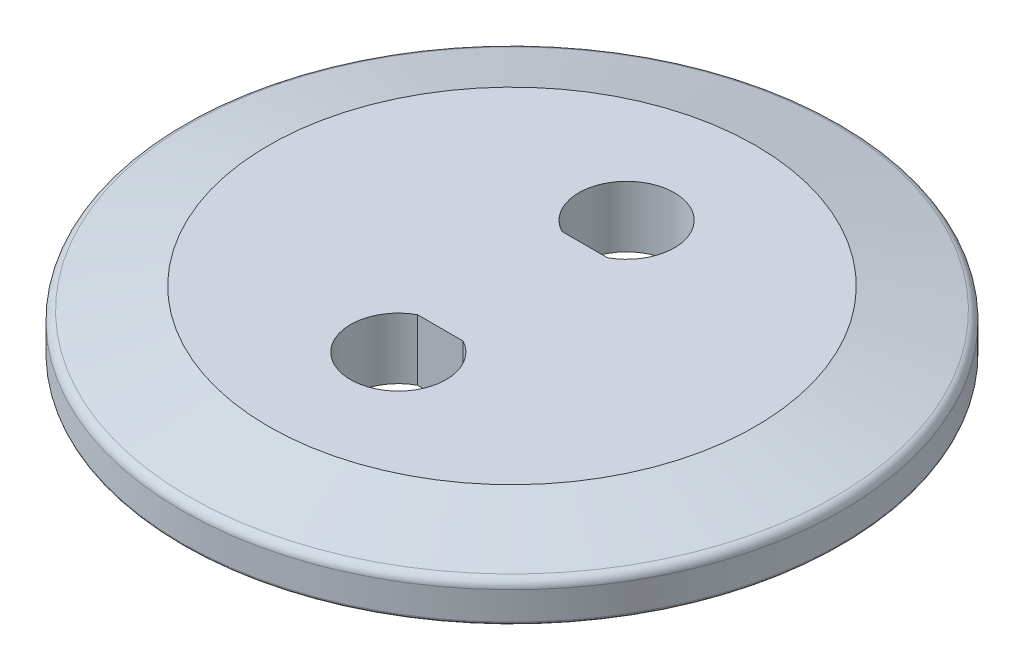
ISO-10303-21;
HEADER;
FILE_DESCRIPTION(('STEP AP214'),'2;1');
FILE_NAME('part.step','',(''),(''),'','','');
FILE_SCHEMA(('AUTOMOTIVE_DESIGN { 1 0 10303 214 1 1 1 1 }'));
ENDSEC;
DATA;
#1=APPLICATION_CONTEXT('core data for automotive mechanical design processes');
#2=APPLICATION_PROTOCOL_DEFINITION('international standard','automotive_design',2000,#1);
#3=PRODUCT_CONTEXT('',#1,'mechanical');
#4=PRODUCT('Part','Part','',(#3));
#5=PRODUCT_RELATED_PRODUCT_CATEGORY('part','',(#4));
#6=PRODUCT_DEFINITION_FORMATION('','',#4);
#7=PRODUCT_DEFINITION_CONTEXT('part definition',#1,'design');
#8=PRODUCT_DEFINITION('design','',#6,#7);
#9=PRODUCT_DEFINITION_SHAPE('','',#8);
#10=(LENGTH_UNIT() NAMED_UNIT(*) SI_UNIT(.MILLI.,.METRE.));
#11=(NAMED_UNIT(*) PLANE_ANGLE_UNIT() SI_UNIT($,.RADIAN.));
#12=(NAMED_UNIT(*) SI_UNIT($,.STERADIAN.) SOLID_ANGLE_UNIT());
#13=UNCERTAINTY_MEASURE_WITH_UNIT(LENGTH_MEASURE(1.E-05),#10,'distance_accuracy_value','');
#14=(GEOMETRIC_REPRESENTATION_CONTEXT(3) GLOBAL_UNCERTAINTY_ASSIGNED_CONTEXT((#13)) GLOBAL_UNIT_ASSIGNED_CONTEXT((#10,
#11,#12)) REPRESENTATION_CONTEXT('',''));
#15=CARTESIAN_POINT('',(0.,0.,0.));
#16=DIRECTION('',(0.,0.,1.));
#17=DIRECTION('',(1.,0.,0.));
#18=AXIS2_PLACEMENT_3D('',#15,#16,#17);
#19=CARTESIAN_POINT('',(0.,5.1,20.3158021954298));
#20=DIRECTION('',(0.,-1.,0.));
#21=DIRECTION('',(0.,0.,-1.));
#22=AXIS2_PLACEMENT_3D('',#19,#20,#21);
#23=PLANE('',#22);
#24=CARTESIAN_POINT('',(0.,5.1,0.));
#25=DIRECTION('',(0.,-1.,0.));
#26=DIRECTION('',(0.,0.,-1.));
#27=AXIS2_PLACEMENT_3D('',#24,#25,#26);
#28=CIRCLE('',#27,20.3158021954298);
#29=CARTESIAN_POINT('',(0.,5.1,-20.3158021954298));
#30=VERTEX_POINT('',#29);
#31=EDGE_CURVE('E149',#30,#30,#28,.T.);
#32=ORIENTED_EDGE('',*,*,#31,.F.);
#33=EDGE_LOOP('',(#32));
#34=FACE_BOUND('',#33,.T.);
#35=DIRECTION('',(1.,0.,0.));
#36=VECTOR('',#35,1.);
#37=CARTESIAN_POINT('',(-1.86254762289826,5.1,-6.0198));
#38=LINE('',#37,#36);
#39=CARTESIAN_POINT('',(-1.86254762289826,5.1,-6.0198));
#40=VERTEX_POINT('',#39);
#41=CARTESIAN_POINT('',(1.94067301230029,5.1,-6.0198));
#42=VERTEX_POINT('',#41);
#43=EDGE_CURVE('E117',#40,#42,#38,.T.);
#44=ORIENTED_EDGE('',*,*,#43,.F.);
#45=CARTESIAN_POINT('',(0.0390626947010149,5.1,-9.525));
#46=DIRECTION('',(0.,1.,0.));
#47=DIRECTION('',(0.,0.,1.));
#48=AXIS2_PLACEMENT_3D('',#45,#46,#47);
#49=CIRCLE('',#48,3.9878);
#50=EDGE_CURVE('E110',#42,#40,#49,.T.);
#51=ORIENTED_EDGE('',*,*,#50,.F.);
#52=EDGE_LOOP('',(#44,#51));
#53=FACE_BOUND('',#52,.T.);
#54=CARTESIAN_POINT('',(0.0390626947010149,5.1,9.525));
#55=DIRECTION('',(0.,-1.,0.));
#56=DIRECTION('',(0.,0.,-1.));
#57=AXIS2_PLACEMENT_3D('',#54,#55,#56);
#58=CIRCLE('',#57,3.9878);
#59=CARTESIAN_POINT('',(1.94067301230029,5.1,6.0198));
#60=VERTEX_POINT('',#59);
#61=CARTESIAN_POINT('',(-1.86254762289826,5.1,6.0198));
#62=VERTEX_POINT('',#61);
#63=EDGE_CURVE('E63',#60,#62,#58,.T.);
#64=ORIENTED_EDGE('',*,*,#63,.T.);
#65=DIRECTION('',(1.,0.,0.));
#66=VECTOR('',#65,1.);
#67=CARTESIAN_POINT('',(-1.86254762289826,5.1,6.0198));
#68=LINE('',#67,#66);
#69=EDGE_CURVE('E102',#62,#60,#68,.T.);
#70=ORIENTED_EDGE('',*,*,#69,.T.);
#71=EDGE_LOOP('',(#64,#70));
#72=FACE_BOUND('',#71,.T.);
#73=ADVANCED_FACE('F47',(#34,#53,#72),#23,.F.);
#74=CARTESIAN_POINT('',(0.,0.,0.));
#75=DIRECTION('',(0.,-1.,0.));
#76=DIRECTION('',(0.,0.,-1.));
#77=AXIS2_PLACEMENT_3D('',#74,#75,#76);
#78=PLANE('',#77);
#79=CARTESIAN_POINT('',(0.0390626947010149,0.,-9.525));
#80=DIRECTION('',(0.,1.,0.));
#81=DIRECTION('',(0.,0.,1.));
#82=AXIS2_PLACEMENT_3D('',#79,#80,#81);
#83=CIRCLE('',#82,3.9878);
#84=CARTESIAN_POINT('',(1.94067301230029,0.,-6.0198));
#85=VERTEX_POINT('',#84);
#86=CARTESIAN_POINT('',(-1.86254762289826,0.,-6.0198));
#87=VERTEX_POINT('',#86);
#88=EDGE_CURVE('E112',#85,#87,#83,.T.);
#89=ORIENTED_EDGE('',*,*,#88,.T.);
#90=DIRECTION('',(1.,0.,0.));
#91=VECTOR('',#90,1.);
#92=CARTESIAN_POINT('',(-1.86254762289826,0.,-6.0198));
#93=LINE('',#92,#91);
#94=EDGE_CURVE('E116',#87,#85,#93,.T.);
#95=ORIENTED_EDGE('',*,*,#94,.T.);
#96=EDGE_LOOP('',(#89,#95));
#97=FACE_BOUND('',#96,.T.);
#98=CARTESIAN_POINT('',(0.,0.,0.));
#99=DIRECTION('',(0.,1.,0.));
#100=DIRECTION('',(0.,0.,1.));
#101=AXIS2_PLACEMENT_3D('',#98,#99,#100);
#102=CIRCLE('',#101,15.85);
#103=CARTESIAN_POINT('',(0.,0.,15.85));
#104=VERTEX_POINT('',#103);
#105=EDGE_CURVE('E130',#104,#104,#102,.T.);
#106=ORIENTED_EDGE('',*,*,#105,.F.);
#107=EDGE_LOOP('',(#106));
#108=FACE_BOUND('',#107,.T.);
#109=DIRECTION('',(1.,0.,0.));
#110=VECTOR('',#109,1.);
#111=CARTESIAN_POINT('',(-1.86254762289826,0.,6.0198));
#112=LINE('',#111,#110);
#113=CARTESIAN_POINT('',(-1.86254762289826,0.,6.0198));
#114=VERTEX_POINT('',#113);
#115=CARTESIAN_POINT('',(1.94067301230029,0.,6.0198));
#116=VERTEX_POINT('',#115);
#117=EDGE_CURVE('E88',#114,#116,#112,.T.);
#118=ORIENTED_EDGE('',*,*,#117,.F.);
#119=CARTESIAN_POINT('',(0.0390626947010149,0.,9.525));
#120=DIRECTION('',(0.,-1.,0.));
#121=DIRECTION('',(0.,0.,-1.));
#122=AXIS2_PLACEMENT_3D('',#119,#120,#121);
#123=CIRCLE('',#122,3.9878);
#124=EDGE_CURVE('E95',#116,#114,#123,.T.);
#125=ORIENTED_EDGE('',*,*,#124,.F.);
#126=EDGE_LOOP('',(#118,#125));
#127=FACE_BOUND('',#126,.T.);
#128=ADVANCED_FACE('F100',(#97,#108,#127),#78,.T.);
#129=CARTESIAN_POINT('',(0.,0.,20.625));
#130=DIRECTION('',(0.,1.,0.));
#131=DIRECTION('',(0.,0.,1.));
#132=AXIS2_PLACEMENT_3D('',#129,#130,#131);
#133=PLANE('',#132);
#134=CARTESIAN_POINT('',(0.,0.,0.));
#135=DIRECTION('',(0.,1.,0.));
#136=DIRECTION('',(0.,0.,1.));
#137=AXIS2_PLACEMENT_3D('',#134,#135,#136);
#138=CIRCLE('',#137,27.246);
#139=CARTESIAN_POINT('',(0.,0.,27.246));
#140=VERTEX_POINT('',#139);
#141=EDGE_CURVE('E56',#140,#140,#138,.F.);
#142=ORIENTED_EDGE('',*,*,#141,.T.);
#143=EDGE_LOOP('',(#142));
#144=FACE_BOUND('',#143,.T.);
#145=CARTESIAN_POINT('',(0.,0.,0.));
#146=DIRECTION('',(0.,-1.,0.));
#147=DIRECTION('',(0.,0.,-1.));
#148=AXIS2_PLACEMENT_3D('',#145,#146,#147);
#149=CIRCLE('',#148,20.625);
#150=CARTESIAN_POINT('',(0.,0.,-20.625));
#151=VERTEX_POINT('',#150);
#152=EDGE_CURVE('E141',#151,#151,#149,.T.);
#153=ORIENTED_EDGE('',*,*,#152,.F.);
#154=EDGE_LOOP('',(#153));
#155=FACE_BOUND('',#154,.T.);
#156=ADVANCED_FACE('F164',(#144,#155),#133,.F.);
#157=CARTESIAN_POINT('',(0.,0.,0.));
#158=DIRECTION('',(0.,-1.,0.));
#159=DIRECTION('',(0.,0.,-1.));
#160=AXIS2_PLACEMENT_3D('',#157,#158,#159);
#161=CYLINDRICAL_SURFACE('',#160,27.5);
#162=CARTESIAN_POINT('',(0.,0.253999999999999,0.));
#163=DIRECTION('',(0.,1.,0.));
#164=DIRECTION('',(0.,0.,1.));
#165=AXIS2_PLACEMENT_3D('',#162,#163,#164);
#166=CIRCLE('',#165,27.5);
#167=CARTESIAN_POINT('',(0.,0.253999999999999,27.5));
#168=VERTEX_POINT('',#167);
#169=EDGE_CURVE('E11',#168,#168,#166,.T.);
#170=ORIENTED_EDGE('',*,*,#169,.T.);
#171=EDGE_LOOP('',(#170));
#172=FACE_BOUND('',#171,.T.);
#173=CARTESIAN_POINT('',(0.,2.59029683516003,0.));
#174=DIRECTION('',(0.,1.,0.));
#175=DIRECTION('',(0.,0.,1.));
#176=AXIS2_PLACEMENT_3D('',#173,#174,#175);
#177=CIRCLE('',#176,27.5);
#178=CARTESIAN_POINT('',(0.,2.59029683516003,27.5));
#179=VERTEX_POINT('',#178);
#180=EDGE_CURVE('E153',#179,#179,#177,.F.);
#181=ORIENTED_EDGE('',*,*,#180,.T.);
#182=EDGE_LOOP('',(#181));
#183=FACE_BOUND('',#182,.T.);
#184=ADVANCED_FACE('F198',(#172,#183),#161,.T.);
#185=CARTESIAN_POINT('',(0.,5.1,0.));
#186=DIRECTION('',(0.,-1.,0.));
#187=DIRECTION('',(0.,0.,-1.));
#188=AXIS2_PLACEMENT_3D('',#185,#186,#187);
#189=CONICAL_SURFACE('',#188,20.3158021954298,1.30899693899575);
#190=CARTESIAN_POINT('',(0.,3.3263323147923,0.));
#191=DIRECTION('',(0.,1.,0.));
#192=DIRECTION('',(0.,0.,1.));
#193=AXIS2_PLACEMENT_3D('',#190,#191,#192);
#194=CIRCLE('',#193,26.9352201123681);
#195=CARTESIAN_POINT('',(0.,3.3263323147923,26.9352201123681));
#196=VERTEX_POINT('',#195);
#197=EDGE_CURVE('E157',#196,#196,#194,.T.);
#198=ORIENTED_EDGE('',*,*,#197,.T.);
#199=EDGE_LOOP('',(#198));
#200=FACE_BOUND('',#199,.T.);
#201=ORIENTED_EDGE('',*,*,#31,.T.);
#202=EDGE_LOOP('',(#201));
#203=FACE_BOUND('',#202,.T.);
#204=ADVANCED_FACE('F195',(#200,#203),#189,.T.);
#205=CARTESIAN_POINT('',(0.,2.5,0.));
#206=DIRECTION('',(0.,1.,0.));
#207=DIRECTION('',(0.,0.,1.));
#208=AXIS2_PLACEMENT_3D('',#205,#206,#207);
#209=PLANE('',#208);
#210=CARTESIAN_POINT('',(0.,2.5,0.));
#211=DIRECTION('',(0.,1.,0.));
#212=DIRECTION('',(0.,0.,1.));
#213=AXIS2_PLACEMENT_3D('',#210,#211,#212);
#214=CIRCLE('',#213,15.85);
#215=CARTESIAN_POINT('',(0.,2.5,15.85));
#216=VERTEX_POINT('',#215);
#217=EDGE_CURVE('E137',#216,#216,#214,.T.);
#218=ORIENTED_EDGE('',*,*,#217,.T.);
#219=EDGE_LOOP('',(#218));
#220=FACE_BOUND('',#219,.T.);
#221=CARTESIAN_POINT('',(0.,2.5,0.));
#222=DIRECTION('',(0.,-1.,0.));
#223=DIRECTION('',(0.,0.,-1.));
#224=AXIS2_PLACEMENT_3D('',#221,#222,#223);
#225=CIRCLE('',#224,20.625);
#226=CARTESIAN_POINT('',(0.,2.5,-20.625));
#227=VERTEX_POINT('',#226);
#228=EDGE_CURVE('E145',#227,#227,#225,.T.);
#229=ORIENTED_EDGE('',*,*,#228,.T.);
#230=EDGE_LOOP('',(#229));
#231=FACE_BOUND('',#230,.T.);
#232=ADVANCED_FACE('F193',(#220,#231),#209,.F.);
#233=CARTESIAN_POINT('',(0.,0.,0.));
#234=DIRECTION('',(0.,-1.,0.));
#235=DIRECTION('',(0.,0.,-1.));
#236=AXIS2_PLACEMENT_3D('',#233,#234,#235);
#237=CYLINDRICAL_SURFACE('',#236,20.625);
#238=ORIENTED_EDGE('',*,*,#228,.F.);
#239=EDGE_LOOP('',(#238));
#240=FACE_BOUND('',#239,.T.);
#241=ORIENTED_EDGE('',*,*,#152,.T.);
#242=EDGE_LOOP('',(#241));
#243=FACE_BOUND('',#242,.T.);
#244=ADVANCED_FACE('F219',(#240,#243),#237,.F.);
#245=CARTESIAN_POINT('',(0.,0.,0.));
#246=DIRECTION('',(0.,1.,0.));
#247=DIRECTION('',(0.,0.,1.));
#248=AXIS2_PLACEMENT_3D('',#245,#246,#247);
#249=CYLINDRICAL_SURFACE('',#248,15.85);
#250=ORIENTED_EDGE('',*,*,#105,.T.);
#251=EDGE_LOOP('',(#250));
#252=FACE_BOUND('',#251,.T.);
#253=ORIENTED_EDGE('',*,*,#217,.F.);
#254=EDGE_LOOP('',(#253));
#255=FACE_BOUND('',#254,.T.);
#256=ADVANCED_FACE('F178',(#252,#255),#249,.T.);
#257=CARTESIAN_POINT('',(0.,2.59029683516003,0.));
#258=DIRECTION('',(0.,1.,0.));
#259=DIRECTION('',(0.,0.,1.));
#260=AXIS2_PLACEMENT_3D('',#257,#258,#259);
#261=TOROIDAL_SURFACE('',#260,26.738,0.762);
#262=ORIENTED_EDGE('',*,*,#197,.F.);
#263=EDGE_LOOP('',(#262));
#264=FACE_BOUND('',#263,.T.);
#265=ORIENTED_EDGE('',*,*,#180,.F.);
#266=EDGE_LOOP('',(#265));
#267=FACE_BOUND('',#266,.T.);
#268=ADVANCED_FACE('F169',(#264,#267),#261,.T.);
#269=CARTESIAN_POINT('',(0.,0.253999999999999,0.));
#270=DIRECTION('',(0.,1.,0.));
#271=DIRECTION('',(0.,0.,1.));
#272=AXIS2_PLACEMENT_3D('',#269,#270,#271);
#273=TOROIDAL_SURFACE('',#272,27.246,0.254);
#274=ORIENTED_EDGE('',*,*,#169,.F.);
#275=EDGE_LOOP('',(#274));
#276=FACE_BOUND('',#275,.T.);
#277=ORIENTED_EDGE('',*,*,#141,.F.);
#278=EDGE_LOOP('',(#277));
#279=FACE_BOUND('',#278,.T.);
#280=ADVANCED_FACE('F49',(#276,#279),#273,.T.);
#281=CARTESIAN_POINT('',(0.0390626947010149,0.,-9.525));
#282=DIRECTION('',(0.,1.,0.));
#283=DIRECTION('',(0.,0.,1.));
#284=AXIS2_PLACEMENT_3D('',#281,#282,#283);
#285=CYLINDRICAL_SURFACE('',#284,3.9878);
#286=ORIENTED_EDGE('',*,*,#50,.T.);
#287=DIRECTION('',(0.,1.,0.));
#288=VECTOR('',#287,1.);
#289=CARTESIAN_POINT('',(-1.86254762289826,0.,-6.0198));
#290=LINE('',#289,#288);
#291=EDGE_CURVE('E121',#87,#40,#290,.T.);
#292=ORIENTED_EDGE('',*,*,#291,.F.);
#293=ORIENTED_EDGE('',*,*,#88,.F.);
#294=DIRECTION('',(0.,1.,0.));
#295=VECTOR('',#294,1.);
#296=CARTESIAN_POINT('',(1.94067301230029,0.,-6.0198));
#297=LINE('',#296,#295);
#298=EDGE_CURVE('E127',#85,#42,#297,.T.);
#299=ORIENTED_EDGE('',*,*,#298,.T.);
#300=EDGE_LOOP('',(#286,#292,#293,#299));
#301=FACE_BOUND('',#300,.T.);
#302=ADVANCED_FACE('F168',(#301),#285,.F.);
#303=CARTESIAN_POINT('',(-1.86254762289826,0.,-6.0198));
#304=DIRECTION('',(0.,0.,1.));
#305=DIRECTION('',(1.,0.,0.));
#306=AXIS2_PLACEMENT_3D('',#303,#304,#305);
#307=PLANE('',#306);
#308=ORIENTED_EDGE('',*,*,#43,.T.);
#309=ORIENTED_EDGE('',*,*,#298,.F.);
#310=ORIENTED_EDGE('',*,*,#94,.F.);
#311=ORIENTED_EDGE('',*,*,#291,.T.);
#312=EDGE_LOOP('',(#308,#309,#310,#311));
#313=FACE_BOUND('',#312,.T.);
#314=ADVANCED_FACE('F175',(#313),#307,.F.);
#315=CARTESIAN_POINT('',(0.0390626947010149,0.,9.525));
#316=DIRECTION('',(0.,1.,0.));
#317=DIRECTION('',(0.,0.,1.));
#318=AXIS2_PLACEMENT_3D('',#315,#316,#317);
#319=CYLINDRICAL_SURFACE('',#318,3.9878);
#320=ORIENTED_EDGE('',*,*,#63,.F.);
#321=DIRECTION('',(0.,1.,0.));
#322=VECTOR('',#321,1.);
#323=CARTESIAN_POINT('',(1.94067301230029,0.,6.0198));
#324=LINE('',#323,#322);
#325=EDGE_CURVE('E90',#116,#60,#324,.T.);
#326=ORIENTED_EDGE('',*,*,#325,.F.);
#327=ORIENTED_EDGE('',*,*,#124,.T.);
#328=DIRECTION('',(0.,1.,0.));
#329=VECTOR('',#328,1.);
#330=CARTESIAN_POINT('',(-1.86254762289826,0.,6.0198));
#331=LINE('',#330,#329);
#332=EDGE_CURVE('E70',#114,#62,#331,.T.);
#333=ORIENTED_EDGE('',*,*,#332,.T.);
#334=EDGE_LOOP('',(#320,#326,#327,#333));
#335=FACE_BOUND('',#334,.T.);
#336=ADVANCED_FACE('F97',(#335),#319,.F.);
#337=CARTESIAN_POINT('',(-1.86254762289826,0.,6.0198));
#338=DIRECTION('',(0.,0.,1.));
#339=DIRECTION('',(1.,0.,0.));
#340=AXIS2_PLACEMENT_3D('',#337,#338,#339);
#341=PLANE('',#340);
#342=ORIENTED_EDGE('',*,*,#69,.F.);
#343=ORIENTED_EDGE('',*,*,#332,.F.);
#344=ORIENTED_EDGE('',*,*,#117,.T.);
#345=ORIENTED_EDGE('',*,*,#325,.T.);
#346=EDGE_LOOP('',(#342,#343,#344,#345));
#347=FACE_BOUND('',#346,.T.);
#348=ADVANCED_FACE('F89',(#347),#341,.T.);
#349=CLOSED_SHELL('',(#73,#128,#156,#184,#204,#232,#244,#256,#268,#280,#302,#314,#336,#348));
#350=MANIFOLD_SOLID_BREP('B2',#349);
#351=ADVANCED_BREP_SHAPE_REPRESENTATION('',(#18,#350),#14);
#352=SHAPE_DEFINITION_REPRESENTATION(#9,#351);
ENDSEC;
END-ISO-10303-21;
